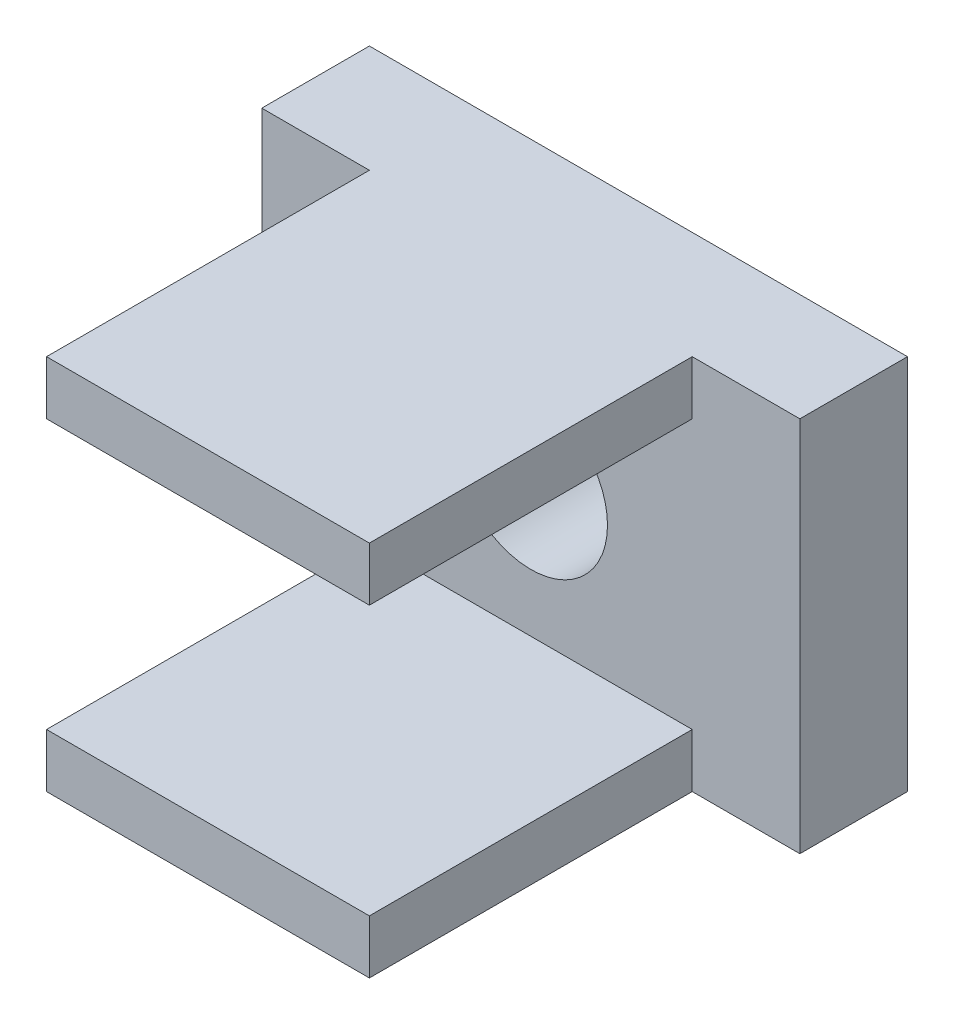
ISO-10303-21;
HEADER;
FILE_DESCRIPTION(('STEP AP214'),'2;1');
FILE_NAME('part.step','',(''),(''),'','','');
FILE_SCHEMA(('AUTOMOTIVE_DESIGN { 1 0 10303 214 1 1 1 1 }'));
ENDSEC;
DATA;
#1=APPLICATION_CONTEXT('core data for automotive mechanical design processes');
#2=APPLICATION_PROTOCOL_DEFINITION('international standard','automotive_design',2000,#1);
#3=PRODUCT_CONTEXT('',#1,'mechanical');
#4=PRODUCT('Part','Part','',(#3));
#5=PRODUCT_RELATED_PRODUCT_CATEGORY('part','',(#4));
#6=PRODUCT_DEFINITION_FORMATION('','',#4);
#7=PRODUCT_DEFINITION_CONTEXT('part definition',#1,'design');
#8=PRODUCT_DEFINITION('design','',#6,#7);
#9=PRODUCT_DEFINITION_SHAPE('','',#8);
#10=(LENGTH_UNIT() NAMED_UNIT(*) SI_UNIT(.MILLI.,.METRE.));
#11=(NAMED_UNIT(*) PLANE_ANGLE_UNIT() SI_UNIT($,.RADIAN.));
#12=(NAMED_UNIT(*) SI_UNIT($,.STERADIAN.) SOLID_ANGLE_UNIT());
#13=UNCERTAINTY_MEASURE_WITH_UNIT(LENGTH_MEASURE(1.E-05),#10,'distance_accuracy_value','');
#14=(GEOMETRIC_REPRESENTATION_CONTEXT(3) GLOBAL_UNCERTAINTY_ASSIGNED_CONTEXT((#13)) GLOBAL_UNIT_ASSIGNED_CONTEXT((#10,
#11,#12)) REPRESENTATION_CONTEXT('',''));
#15=CARTESIAN_POINT('',(0.,0.,0.));
#16=DIRECTION('',(0.,0.,1.));
#17=DIRECTION('',(1.,0.,0.));
#18=AXIS2_PLACEMENT_3D('',#15,#16,#17);
#19=CARTESIAN_POINT('',(0.,0.,2.));
#20=DIRECTION('',(0.,0.,-1.));
#21=DIRECTION('',(-1.,0.,0.));
#22=AXIS2_PLACEMENT_3D('',#19,#20,#21);
#23=PLANE('',#22);
#24=CARTESIAN_POINT('',(0.,0.,2.));
#25=DIRECTION('',(0.,0.,1.));
#26=DIRECTION('',(1.,0.,0.));
#27=AXIS2_PLACEMENT_3D('',#24,#25,#26);
#28=CIRCLE('',#27,1.425);
#29=CARTESIAN_POINT('',(1.425,0.,2.));
#30=VERTEX_POINT('',#29);
#31=EDGE_CURVE('E200',#30,#30,#28,.T.);
#32=ORIENTED_EDGE('',*,*,#31,.F.);
#33=EDGE_LOOP('',(#32));
#34=FACE_BOUND('',#33,.T.);
#35=DIRECTION('',(0.,-1.,0.));
#36=VECTOR('',#35,1.);
#37=CARTESIAN_POINT('',(-3.,-3.5,2.));
#38=LINE('',#37,#36);
#39=CARTESIAN_POINT('',(-3.,-2.5,2.));
#40=VERTEX_POINT('',#39);
#41=CARTESIAN_POINT('',(-3.,-3.5,2.));
#42=VERTEX_POINT('',#41);
#43=EDGE_CURVE('E55',#40,#42,#38,.T.);
#44=ORIENTED_EDGE('',*,*,#43,.F.);
#45=DIRECTION('',(-1.,0.,0.));
#46=VECTOR('',#45,1.);
#47=CARTESIAN_POINT('',(-3.,-2.5,2.));
#48=LINE('',#47,#46);
#49=CARTESIAN_POINT('',(3.,-2.5,2.));
#50=VERTEX_POINT('',#49);
#51=EDGE_CURVE('E59',#50,#40,#48,.T.);
#52=ORIENTED_EDGE('',*,*,#51,.F.);
#53=DIRECTION('',(0.,1.,0.));
#54=VECTOR('',#53,1.);
#55=CARTESIAN_POINT('',(3.,-3.5,2.));
#56=LINE('',#55,#54);
#57=CARTESIAN_POINT('',(3.,-3.5,2.));
#58=VERTEX_POINT('',#57);
#59=EDGE_CURVE('E261',#58,#50,#56,.T.);
#60=ORIENTED_EDGE('',*,*,#59,.F.);
#61=DIRECTION('',(1.,0.,0.));
#62=VECTOR('',#61,1.);
#63=CARTESIAN_POINT('',(-5.,-3.5,2.));
#64=LINE('',#63,#62);
#65=CARTESIAN_POINT('',(5.,-3.5,2.));
#66=VERTEX_POINT('',#65);
#67=EDGE_CURVE('E221',#58,#66,#64,.T.);
#68=ORIENTED_EDGE('',*,*,#67,.T.);
#69=DIRECTION('',(0.,1.,0.));
#70=VECTOR('',#69,1.);
#71=CARTESIAN_POINT('',(5.,-3.5,2.));
#72=LINE('',#71,#70);
#73=CARTESIAN_POINT('',(5.,3.5,2.));
#74=VERTEX_POINT('',#73);
#75=EDGE_CURVE('E209',#66,#74,#72,.T.);
#76=ORIENTED_EDGE('',*,*,#75,.T.);
#77=DIRECTION('',(-1.,0.,0.));
#78=VECTOR('',#77,1.);
#79=CARTESIAN_POINT('',(-5.,3.5,2.));
#80=LINE('',#79,#78);
#81=CARTESIAN_POINT('',(3.,3.5,2.));
#82=VERTEX_POINT('',#81);
#83=EDGE_CURVE('E215',#74,#82,#80,.T.);
#84=ORIENTED_EDGE('',*,*,#83,.T.);
#85=DIRECTION('',(0.,1.,0.));
#86=VECTOR('',#85,1.);
#87=CARTESIAN_POINT('',(3.,3.5,2.));
#88=LINE('',#87,#86);
#89=CARTESIAN_POINT('',(3.,2.5,2.));
#90=VERTEX_POINT('',#89);
#91=EDGE_CURVE('E169',#90,#82,#88,.T.);
#92=ORIENTED_EDGE('',*,*,#91,.F.);
#93=DIRECTION('',(1.,0.,0.));
#94=VECTOR('',#93,1.);
#95=CARTESIAN_POINT('',(-3.,2.5,2.));
#96=LINE('',#95,#94);
#97=CARTESIAN_POINT('',(-3.,2.5,2.));
#98=VERTEX_POINT('',#97);
#99=EDGE_CURVE('E158',#98,#90,#96,.T.);
#100=ORIENTED_EDGE('',*,*,#99,.F.);
#101=DIRECTION('',(0.,-1.,0.));
#102=VECTOR('',#101,1.);
#103=CARTESIAN_POINT('',(-3.,3.5,2.));
#104=LINE('',#103,#102);
#105=CARTESIAN_POINT('',(-3.,3.5,2.));
#106=VERTEX_POINT('',#105);
#107=EDGE_CURVE('E153',#106,#98,#104,.T.);
#108=ORIENTED_EDGE('',*,*,#107,.F.);
#109=CARTESIAN_POINT('',(-5.,3.5,2.));
#110=VERTEX_POINT('',#109);
#111=EDGE_CURVE('E213',#106,#110,#80,.T.);
#112=ORIENTED_EDGE('',*,*,#111,.T.);
#113=DIRECTION('',(0.,-1.,0.));
#114=VECTOR('',#113,1.);
#115=CARTESIAN_POINT('',(-5.,-3.5,2.));
#116=LINE('',#115,#114);
#117=CARTESIAN_POINT('',(-5.,-3.5,2.));
#118=VERTEX_POINT('',#117);
#119=EDGE_CURVE('E218',#110,#118,#116,.T.);
#120=ORIENTED_EDGE('',*,*,#119,.T.);
#121=EDGE_CURVE('E222',#118,#42,#64,.T.);
#122=ORIENTED_EDGE('',*,*,#121,.T.);
#123=EDGE_LOOP('',(#44,#52,#60,#68,#76,#84,#92,#100,#108,#112,#120,#122));
#124=FACE_BOUND('',#123,.T.);
#125=ADVANCED_FACE('F39',(#34,#124),#23,.F.);
#126=CARTESIAN_POINT('',(5.,-3.5,2.));
#127=DIRECTION('',(-1.,0.,0.));
#128=DIRECTION('',(0.,0.,1.));
#129=AXIS2_PLACEMENT_3D('',#126,#127,#128);
#130=PLANE('',#129);
#131=DIRECTION('',(0.,1.,0.));
#132=VECTOR('',#131,1.);
#133=CARTESIAN_POINT('',(5.,-3.5,0.));
#134=LINE('',#133,#132);
#135=CARTESIAN_POINT('',(5.,-3.5,0.));
#136=VERTEX_POINT('',#135);
#137=CARTESIAN_POINT('',(5.,3.5,0.));
#138=VERTEX_POINT('',#137);
#139=EDGE_CURVE('E205',#136,#138,#134,.T.);
#140=ORIENTED_EDGE('',*,*,#139,.T.);
#141=DIRECTION('',(0.,0.,-1.));
#142=VECTOR('',#141,1.);
#143=CARTESIAN_POINT('',(5.,3.5,2.));
#144=LINE('',#143,#142);
#145=EDGE_CURVE('E11',#74,#138,#144,.T.);
#146=ORIENTED_EDGE('',*,*,#145,.F.);
#147=ORIENTED_EDGE('',*,*,#75,.F.);
#148=DIRECTION('',(0.,0.,-1.));
#149=VECTOR('',#148,1.);
#150=CARTESIAN_POINT('',(5.,-3.5,2.));
#151=LINE('',#150,#149);
#152=EDGE_CURVE('E225',#66,#136,#151,.T.);
#153=ORIENTED_EDGE('',*,*,#152,.T.);
#154=EDGE_LOOP('',(#140,#146,#147,#153));
#155=FACE_BOUND('',#154,.T.);
#156=ADVANCED_FACE('F41',(#155),#130,.F.);
#157=CARTESIAN_POINT('',(-5.,3.5,2.));
#158=DIRECTION('',(0.,-1.,0.));
#159=DIRECTION('',(0.,0.,-1.));
#160=AXIS2_PLACEMENT_3D('',#157,#158,#159);
#161=PLANE('',#160);
#162=DIRECTION('',(-1.,0.,0.));
#163=VECTOR('',#162,1.);
#164=CARTESIAN_POINT('',(-5.,3.5,0.));
#165=LINE('',#164,#163);
#166=CARTESIAN_POINT('',(-5.,3.5,0.));
#167=VERTEX_POINT('',#166);
#168=EDGE_CURVE('E229',#138,#167,#165,.T.);
#169=ORIENTED_EDGE('',*,*,#168,.T.);
#170=DIRECTION('',(0.,0.,-1.));
#171=VECTOR('',#170,1.);
#172=CARTESIAN_POINT('',(-5.,3.5,2.));
#173=LINE('',#172,#171);
#174=EDGE_CURVE('E48',#110,#167,#173,.T.);
#175=ORIENTED_EDGE('',*,*,#174,.F.);
#176=ORIENTED_EDGE('',*,*,#111,.F.);
#177=DIRECTION('',(0.,0.,-1.));
#178=VECTOR('',#177,1.);
#179=CARTESIAN_POINT('',(-3.,3.5,8.));
#180=LINE('',#179,#178);
#181=CARTESIAN_POINT('',(-3.,3.5,8.));
#182=VERTEX_POINT('',#181);
#183=EDGE_CURVE('E177',#182,#106,#180,.T.);
#184=ORIENTED_EDGE('',*,*,#183,.F.);
#185=DIRECTION('',(-1.,0.,0.));
#186=VECTOR('',#185,1.);
#187=CARTESIAN_POINT('',(-3.,3.5,8.));
#188=LINE('',#187,#186);
#189=CARTESIAN_POINT('',(3.,3.5,8.));
#190=VERTEX_POINT('',#189);
#191=EDGE_CURVE('E175',#190,#182,#188,.T.);
#192=ORIENTED_EDGE('',*,*,#191,.F.);
#193=DIRECTION('',(0.,0.,-1.));
#194=VECTOR('',#193,1.);
#195=CARTESIAN_POINT('',(3.,3.5,8.));
#196=LINE('',#195,#194);
#197=EDGE_CURVE('E188',#190,#82,#196,.T.);
#198=ORIENTED_EDGE('',*,*,#197,.T.);
#199=ORIENTED_EDGE('',*,*,#83,.F.);
#200=ORIENTED_EDGE('',*,*,#145,.T.);
#201=EDGE_LOOP('',(#169,#175,#176,#184,#192,#198,#199,#200));
#202=FACE_BOUND('',#201,.T.);
#203=ADVANCED_FACE('F265',(#202),#161,.F.);
#204=CARTESIAN_POINT('',(-5.,-3.5,2.));
#205=DIRECTION('',(1.,0.,0.));
#206=DIRECTION('',(0.,0.,-1.));
#207=AXIS2_PLACEMENT_3D('',#204,#205,#206);
#208=PLANE('',#207);
#209=DIRECTION('',(0.,-1.,0.));
#210=VECTOR('',#209,1.);
#211=CARTESIAN_POINT('',(-5.,-3.5,0.));
#212=LINE('',#211,#210);
#213=CARTESIAN_POINT('',(-5.,-3.5,0.));
#214=VERTEX_POINT('',#213);
#215=EDGE_CURVE('E232',#167,#214,#212,.T.);
#216=ORIENTED_EDGE('',*,*,#215,.T.);
#217=DIRECTION('',(0.,0.,-1.));
#218=VECTOR('',#217,1.);
#219=CARTESIAN_POINT('',(-5.,-3.5,2.));
#220=LINE('',#219,#218);
#221=EDGE_CURVE('E240',#118,#214,#220,.T.);
#222=ORIENTED_EDGE('',*,*,#221,.F.);
#223=ORIENTED_EDGE('',*,*,#119,.F.);
#224=ORIENTED_EDGE('',*,*,#174,.T.);
#225=EDGE_LOOP('',(#216,#222,#223,#224));
#226=FACE_BOUND('',#225,.T.);
#227=ADVANCED_FACE('F249',(#226),#208,.F.);
#228=CARTESIAN_POINT('',(-5.,-3.5,2.));
#229=DIRECTION('',(0.,1.,0.));
#230=DIRECTION('',(0.,0.,1.));
#231=AXIS2_PLACEMENT_3D('',#228,#229,#230);
#232=PLANE('',#231);
#233=DIRECTION('',(1.,0.,0.));
#234=VECTOR('',#233,1.);
#235=CARTESIAN_POINT('',(-5.,-3.5,0.));
#236=LINE('',#235,#234);
#237=EDGE_CURVE('E214',#214,#136,#236,.T.);
#238=ORIENTED_EDGE('',*,*,#237,.T.);
#239=ORIENTED_EDGE('',*,*,#152,.F.);
#240=ORIENTED_EDGE('',*,*,#67,.F.);
#241=DIRECTION('',(0.,0.,-1.));
#242=VECTOR('',#241,1.);
#243=CARTESIAN_POINT('',(3.,-3.5,8.));
#244=LINE('',#243,#242);
#245=CARTESIAN_POINT('',(3.,-3.5,8.));
#246=VERTEX_POINT('',#245);
#247=EDGE_CURVE('E135',#246,#58,#244,.T.);
#248=ORIENTED_EDGE('',*,*,#247,.F.);
#249=DIRECTION('',(1.,0.,0.));
#250=VECTOR('',#249,1.);
#251=CARTESIAN_POINT('',(-3.,-3.5,8.));
#252=LINE('',#251,#250);
#253=CARTESIAN_POINT('',(-3.,-3.5,8.));
#254=VERTEX_POINT('',#253);
#255=EDGE_CURVE('E128',#254,#246,#252,.T.);
#256=ORIENTED_EDGE('',*,*,#255,.F.);
#257=DIRECTION('',(0.,0.,-1.));
#258=VECTOR('',#257,1.);
#259=CARTESIAN_POINT('',(-3.,-3.5,8.));
#260=LINE('',#259,#258);
#261=EDGE_CURVE('E133',#254,#42,#260,.T.);
#262=ORIENTED_EDGE('',*,*,#261,.T.);
#263=ORIENTED_EDGE('',*,*,#121,.F.);
#264=ORIENTED_EDGE('',*,*,#221,.T.);
#265=EDGE_LOOP('',(#238,#239,#240,#248,#256,#262,#263,#264));
#266=FACE_BOUND('',#265,.T.);
#267=ADVANCED_FACE('F130',(#266),#232,.F.);
#268=CARTESIAN_POINT('',(0.,0.,0.));
#269=DIRECTION('',(0.,0.,-1.));
#270=DIRECTION('',(-1.,0.,0.));
#271=AXIS2_PLACEMENT_3D('',#268,#269,#270);
#272=PLANE('',#271);
#273=CARTESIAN_POINT('',(0.,0.,0.));
#274=DIRECTION('',(0.,0.,1.));
#275=DIRECTION('',(1.,0.,0.));
#276=AXIS2_PLACEMENT_3D('',#273,#274,#275);
#277=CIRCLE('',#276,1.425);
#278=CARTESIAN_POINT('',(1.425,0.,0.));
#279=VERTEX_POINT('',#278);
#280=EDGE_CURVE('E201',#279,#279,#277,.T.);
#281=ORIENTED_EDGE('',*,*,#280,.T.);
#282=EDGE_LOOP('',(#281));
#283=FACE_BOUND('',#282,.T.);
#284=ORIENTED_EDGE('',*,*,#139,.F.);
#285=ORIENTED_EDGE('',*,*,#237,.F.);
#286=ORIENTED_EDGE('',*,*,#215,.F.);
#287=ORIENTED_EDGE('',*,*,#168,.F.);
#288=EDGE_LOOP('',(#284,#285,#286,#287));
#289=FACE_BOUND('',#288,.T.);
#290=ADVANCED_FACE('F256',(#283,#289),#272,.T.);
#291=CARTESIAN_POINT('',(0.,0.,0.));
#292=DIRECTION('',(0.,0.,1.));
#293=DIRECTION('',(1.,0.,0.));
#294=AXIS2_PLACEMENT_3D('',#291,#292,#293);
#295=CYLINDRICAL_SURFACE('',#294,1.425);
#296=ORIENTED_EDGE('',*,*,#280,.F.);
#297=EDGE_LOOP('',(#296));
#298=FACE_BOUND('',#297,.T.);
#299=ORIENTED_EDGE('',*,*,#31,.T.);
#300=EDGE_LOOP('',(#299));
#301=FACE_BOUND('',#300,.T.);
#302=ADVANCED_FACE('F287',(#298,#301),#295,.F.);
#303=CARTESIAN_POINT('',(-3.,3.5,8.));
#304=DIRECTION('',(1.,0.,0.));
#305=DIRECTION('',(0.,0.,-1.));
#306=AXIS2_PLACEMENT_3D('',#303,#304,#305);
#307=PLANE('',#306);
#308=ORIENTED_EDGE('',*,*,#107,.T.);
#309=DIRECTION('',(0.,0.,-1.));
#310=VECTOR('',#309,1.);
#311=CARTESIAN_POINT('',(-3.,2.5,8.));
#312=LINE('',#311,#310);
#313=CARTESIAN_POINT('',(-3.,2.5,8.));
#314=VERTEX_POINT('',#313);
#315=EDGE_CURVE('E196',#314,#98,#312,.T.);
#316=ORIENTED_EDGE('',*,*,#315,.F.);
#317=DIRECTION('',(0.,-1.,0.));
#318=VECTOR('',#317,1.);
#319=CARTESIAN_POINT('',(-3.,3.5,8.));
#320=LINE('',#319,#318);
#321=EDGE_CURVE('E164',#182,#314,#320,.T.);
#322=ORIENTED_EDGE('',*,*,#321,.F.);
#323=ORIENTED_EDGE('',*,*,#183,.T.);
#324=EDGE_LOOP('',(#308,#316,#322,#323));
#325=FACE_BOUND('',#324,.T.);
#326=ADVANCED_FACE('F269',(#325),#307,.F.);
#327=CARTESIAN_POINT('',(-3.,2.5,8.));
#328=DIRECTION('',(0.,1.,0.));
#329=DIRECTION('',(-1.,0.,0.));
#330=AXIS2_PLACEMENT_3D('',#327,#328,#329);
#331=PLANE('',#330);
#332=ORIENTED_EDGE('',*,*,#99,.T.);
#333=DIRECTION('',(0.,0.,-1.));
#334=VECTOR('',#333,1.);
#335=CARTESIAN_POINT('',(3.,2.5,8.));
#336=LINE('',#335,#334);
#337=CARTESIAN_POINT('',(3.,2.5,8.));
#338=VERTEX_POINT('',#337);
#339=EDGE_CURVE('E192',#338,#90,#336,.T.);
#340=ORIENTED_EDGE('',*,*,#339,.F.);
#341=DIRECTION('',(1.,0.,0.));
#342=VECTOR('',#341,1.);
#343=CARTESIAN_POINT('',(-3.,2.5,8.));
#344=LINE('',#343,#342);
#345=EDGE_CURVE('E168',#314,#338,#344,.T.);
#346=ORIENTED_EDGE('',*,*,#345,.F.);
#347=ORIENTED_EDGE('',*,*,#315,.T.);
#348=EDGE_LOOP('',(#332,#340,#346,#347));
#349=FACE_BOUND('',#348,.T.);
#350=ADVANCED_FACE('F279',(#349),#331,.F.);
#351=CARTESIAN_POINT('',(3.,3.5,8.));
#352=DIRECTION('',(-1.,0.,0.));
#353=DIRECTION('',(0.,0.,1.));
#354=AXIS2_PLACEMENT_3D('',#351,#352,#353);
#355=PLANE('',#354);
#356=ORIENTED_EDGE('',*,*,#91,.T.);
#357=ORIENTED_EDGE('',*,*,#197,.F.);
#358=DIRECTION('',(0.,1.,0.));
#359=VECTOR('',#358,1.);
#360=CARTESIAN_POINT('',(3.,3.5,8.));
#361=LINE('',#360,#359);
#362=EDGE_CURVE('E172',#338,#190,#361,.T.);
#363=ORIENTED_EDGE('',*,*,#362,.F.);
#364=ORIENTED_EDGE('',*,*,#339,.T.);
#365=EDGE_LOOP('',(#356,#357,#363,#364));
#366=FACE_BOUND('',#365,.T.);
#367=ADVANCED_FACE('F277',(#366),#355,.F.);
#368=CARTESIAN_POINT('',(0.,0.,8.));
#369=DIRECTION('',(0.,0.,1.));
#370=DIRECTION('',(1.,0.,0.));
#371=AXIS2_PLACEMENT_3D('',#368,#369,#370);
#372=PLANE('',#371);
#373=ORIENTED_EDGE('',*,*,#321,.T.);
#374=ORIENTED_EDGE('',*,*,#345,.T.);
#375=ORIENTED_EDGE('',*,*,#362,.T.);
#376=ORIENTED_EDGE('',*,*,#191,.T.);
#377=EDGE_LOOP('',(#373,#374,#375,#376));
#378=FACE_BOUND('',#377,.T.);
#379=ADVANCED_FACE('F272',(#378),#372,.T.);
#380=CARTESIAN_POINT('',(-3.,-3.5,8.));
#381=DIRECTION('',(1.,0.,0.));
#382=DIRECTION('',(0.,0.,-1.));
#383=AXIS2_PLACEMENT_3D('',#380,#381,#382);
#384=PLANE('',#383);
#385=ORIENTED_EDGE('',*,*,#43,.T.);
#386=ORIENTED_EDGE('',*,*,#261,.F.);
#387=DIRECTION('',(0.,-1.,0.));
#388=VECTOR('',#387,1.);
#389=CARTESIAN_POINT('',(-3.,-3.5,8.));
#390=LINE('',#389,#388);
#391=CARTESIAN_POINT('',(-3.,-2.5,8.));
#392=VERTEX_POINT('',#391);
#393=EDGE_CURVE('E140',#392,#254,#390,.T.);
#394=ORIENTED_EDGE('',*,*,#393,.F.);
#395=DIRECTION('',(0.,0.,-1.));
#396=VECTOR('',#395,1.);
#397=CARTESIAN_POINT('',(-3.,-2.5,8.));
#398=LINE('',#397,#396);
#399=EDGE_CURVE('E390',#392,#40,#398,.T.);
#400=ORIENTED_EDGE('',*,*,#399,.T.);
#401=EDGE_LOOP('',(#385,#386,#394,#400));
#402=FACE_BOUND('',#401,.T.);
#403=ADVANCED_FACE('F151',(#402),#384,.F.);
#404=CARTESIAN_POINT('',(3.,-3.5,8.));
#405=DIRECTION('',(-1.,0.,0.));
#406=DIRECTION('',(0.,0.,1.));
#407=AXIS2_PLACEMENT_3D('',#404,#405,#406);
#408=PLANE('',#407);
#409=ORIENTED_EDGE('',*,*,#59,.T.);
#410=DIRECTION('',(0.,0.,-1.));
#411=VECTOR('',#410,1.);
#412=CARTESIAN_POINT('',(3.,-2.5,8.));
#413=LINE('',#412,#411);
#414=CARTESIAN_POINT('',(3.,-2.5,8.));
#415=VERTEX_POINT('',#414);
#416=EDGE_CURVE('E160',#415,#50,#413,.T.);
#417=ORIENTED_EDGE('',*,*,#416,.F.);
#418=DIRECTION('',(0.,1.,0.));
#419=VECTOR('',#418,1.);
#420=CARTESIAN_POINT('',(3.,-3.5,8.));
#421=LINE('',#420,#419);
#422=EDGE_CURVE('E139',#246,#415,#421,.T.);
#423=ORIENTED_EDGE('',*,*,#422,.F.);
#424=ORIENTED_EDGE('',*,*,#247,.T.);
#425=EDGE_LOOP('',(#409,#417,#423,#424));
#426=FACE_BOUND('',#425,.T.);
#427=ADVANCED_FACE('F358',(#426),#408,.F.);
#428=CARTESIAN_POINT('',(-3.,-2.5,8.));
#429=DIRECTION('',(0.,-1.,0.));
#430=DIRECTION('',(1.,0.,0.));
#431=AXIS2_PLACEMENT_3D('',#428,#429,#430);
#432=PLANE('',#431);
#433=ORIENTED_EDGE('',*,*,#51,.T.);
#434=ORIENTED_EDGE('',*,*,#399,.F.);
#435=DIRECTION('',(-1.,0.,0.));
#436=VECTOR('',#435,1.);
#437=CARTESIAN_POINT('',(-3.,-2.5,8.));
#438=LINE('',#437,#436);
#439=EDGE_CURVE('E145',#415,#392,#438,.T.);
#440=ORIENTED_EDGE('',*,*,#439,.F.);
#441=ORIENTED_EDGE('',*,*,#416,.T.);
#442=EDGE_LOOP('',(#433,#434,#440,#441));
#443=FACE_BOUND('',#442,.T.);
#444=ADVANCED_FACE('F367',(#443),#432,.F.);
#445=CARTESIAN_POINT('',(0.,0.,8.));
#446=DIRECTION('',(0.,0.,-1.));
#447=DIRECTION('',(-1.,0.,0.));
#448=AXIS2_PLACEMENT_3D('',#445,#446,#447);
#449=PLANE('',#448);
#450=ORIENTED_EDGE('',*,*,#393,.T.);
#451=ORIENTED_EDGE('',*,*,#255,.T.);
#452=ORIENTED_EDGE('',*,*,#422,.T.);
#453=ORIENTED_EDGE('',*,*,#439,.T.);
#454=EDGE_LOOP('',(#450,#451,#452,#453));
#455=FACE_BOUND('',#454,.T.);
#456=ADVANCED_FACE('F143',(#455),#449,.F.);
#457=CLOSED_SHELL('',(#125,#156,#203,#227,#267,#290,#302,#326,#350,#367,#379,#403,#427,#444,#456));
#458=MANIFOLD_SOLID_BREP('B2',#457);
#459=ADVANCED_BREP_SHAPE_REPRESENTATION('',(#18,#458),#14);
#460=SHAPE_DEFINITION_REPRESENTATION(#9,#459);
ENDSEC;
END-ISO-10303-21;
